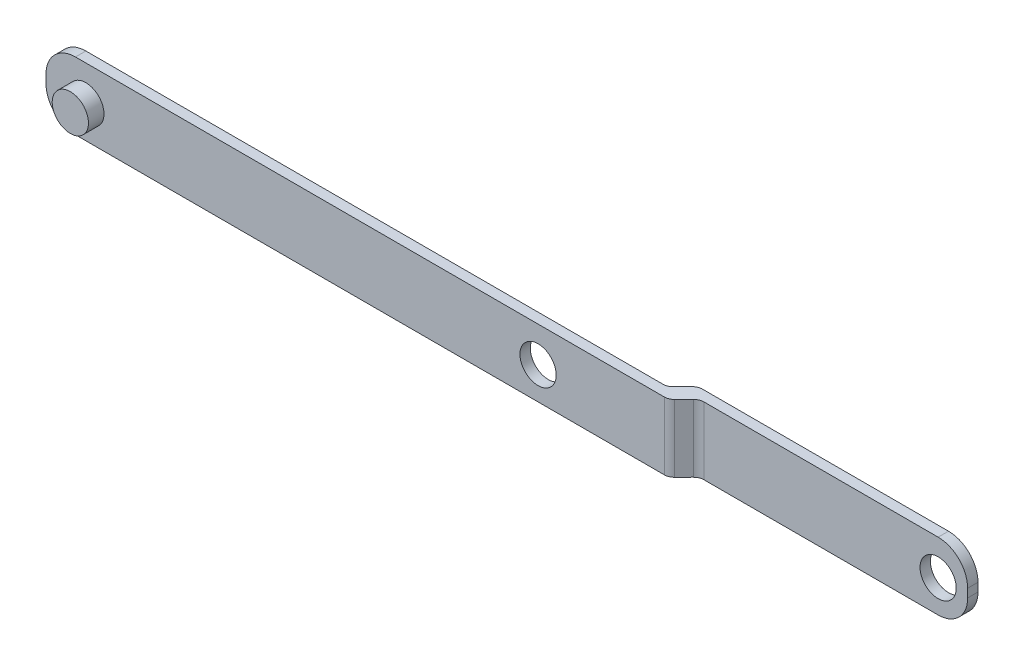
ISO-10303-21;
HEADER;
FILE_DESCRIPTION(('STEP AP214'),'2;1');
FILE_NAME('part.step','',(''),(''),'','','');
FILE_SCHEMA(('AUTOMOTIVE_DESIGN { 1 0 10303 214 1 1 1 1 }'));
ENDSEC;
DATA;
#1=APPLICATION_CONTEXT('core data for automotive mechanical design processes');
#2=APPLICATION_PROTOCOL_DEFINITION('international standard','automotive_design',2000,#1);
#3=PRODUCT_CONTEXT('',#1,'mechanical');
#4=PRODUCT('Part','Part','',(#3));
#5=PRODUCT_RELATED_PRODUCT_CATEGORY('part','',(#4));
#6=PRODUCT_DEFINITION_FORMATION('','',#4);
#7=PRODUCT_DEFINITION_CONTEXT('part definition',#1,'design');
#8=PRODUCT_DEFINITION('design','',#6,#7);
#9=PRODUCT_DEFINITION_SHAPE('','',#8);
#10=(LENGTH_UNIT() NAMED_UNIT(*) SI_UNIT(.MILLI.,.METRE.));
#11=(NAMED_UNIT(*) PLANE_ANGLE_UNIT() SI_UNIT($,.RADIAN.));
#12=(NAMED_UNIT(*) SI_UNIT($,.STERADIAN.) SOLID_ANGLE_UNIT());
#13=UNCERTAINTY_MEASURE_WITH_UNIT(LENGTH_MEASURE(1.E-05),#10,'distance_accuracy_value','');
#14=(GEOMETRIC_REPRESENTATION_CONTEXT(3) GLOBAL_UNCERTAINTY_ASSIGNED_CONTEXT((#13)) GLOBAL_UNIT_ASSIGNED_CONTEXT((#10,
#11,#12)) REPRESENTATION_CONTEXT('',''));
#15=CARTESIAN_POINT('',(0.,0.,0.));
#16=DIRECTION('',(0.,0.,1.));
#17=DIRECTION('',(1.,0.,0.));
#18=AXIS2_PLACEMENT_3D('',#15,#16,#17);
#19=CARTESIAN_POINT('',(82.1603696587962,-0.538806436098636,5.));
#20=DIRECTION('',(0.,0.,1.));
#21=DIRECTION('',(1.,0.,0.));
#22=AXIS2_PLACEMENT_3D('',#19,#20,#21);
#23=PLANE('',#22);
#24=CARTESIAN_POINT('',(-79.4418956808834,0.,5.));
#25=DIRECTION('',(0.,0.,1.));
#26=DIRECTION('',(1.,0.,0.));
#27=AXIS2_PLACEMENT_3D('',#24,#25,#26);
#28=CIRCLE('',#27,3.50000000000001);
#29=CARTESIAN_POINT('',(-75.9418956808834,0.,5.));
#30=VERTEX_POINT('',#29);
#31=EDGE_CURVE('E431',#30,#30,#28,.T.);
#32=ORIENTED_EDGE('',*,*,#31,.F.);
#33=EDGE_LOOP('',(#32));
#34=FACE_BOUND('',#33,.T.);
#35=DIRECTION('',(0.999999997302536,-7.34501783050523E-05,0.));
#36=VECTOR('',#35,1.);
#37=CARTESIAN_POINT('',(-81.4446995578788,-6.22446404853457,5.));
#38=LINE('',#37,#36);
#39=CARTESIAN_POINT('',(-81.4446995578788,-6.22446404853458,5.));
#40=VERTEX_POINT('',#39);
#41=CARTESIAN_POINT('',(32.2717692486687,-6.23281654346716,5.));
#42=VERTEX_POINT('',#41);
#43=EDGE_CURVE('E358',#40,#42,#38,.T.);
#44=ORIENTED_EDGE('',*,*,#43,.T.);
#45=DIRECTION('',(7.34501783050048E-05,0.999999997302536,0.));
#46=VECTOR('',#45,1.);
#47=CARTESIAN_POINT('',(32.2727258091304,6.79043923535657,5.));
#48=LINE('',#47,#46);
#49=CARTESIAN_POINT('',(32.2727258091304,6.79043923535656,5.));
#50=VERTEX_POINT('',#49);
#51=EDGE_CURVE('E287',#42,#50,#48,.T.);
#52=ORIENTED_EDGE('',*,*,#51,.T.);
#53=DIRECTION('',(-0.999999997302536,7.34501783049881E-05,0.));
#54=VECTOR('',#53,1.);
#55=CARTESIAN_POINT('',(82.1609077240558,6.78677493948971,5.));
#56=LINE('',#55,#54);
#57=CARTESIAN_POINT('',(-81.4437429974172,6.79879173028915,5.));
#58=VERTEX_POINT('',#57);
#59=EDGE_CURVE('E362',#50,#58,#56,.T.);
#60=ORIENTED_EDGE('',*,*,#59,.T.);
#61=CARTESIAN_POINT('',(-81.4441614926191,1.10111732705376,5.));
#62=DIRECTION('',(0.,0.,1.));
#63=DIRECTION('',(1.,0.,0.));
#64=AXIS2_PLACEMENT_3D('',#61,#62,#63);
#65=CIRCLE('',#64,5.69767441860467);
#66=CARTESIAN_POINT('',(-87.1418358958545,1.10153582225575,5.));
#67=VERTEX_POINT('',#66);
#68=EDGE_CURVE('E366',#58,#67,#65,.T.);
#69=ORIENTED_EDGE('',*,*,#68,.T.);
#70=DIRECTION('',(-7.34501783028084E-05,-0.999999997302536,0.));
#71=VECTOR('',#70,1.);
#72=CARTESIAN_POINT('',(-87.1418358958545,1.10153582225575,5.));
#73=LINE('',#72,#71);
#74=CARTESIAN_POINT('',(-87.1419554659122,-0.526371150097198,5.));
#75=VERTEX_POINT('',#74);
#76=EDGE_CURVE('E369',#67,#75,#73,.T.);
#77=ORIENTED_EDGE('',*,*,#76,.T.);
#78=CARTESIAN_POINT('',(-81.4442810626769,-0.526789645299211,5.));
#79=DIRECTION('',(0.,0.,1.));
#80=DIRECTION('',(1.,0.,0.));
#81=AXIS2_PLACEMENT_3D('',#78,#79,#80);
#82=CIRCLE('',#81,5.69767441860464);
#83=EDGE_CURVE('E372',#75,#40,#82,.T.);
#84=ORIENTED_EDGE('',*,*,#83,.T.);
#85=EDGE_LOOP('',(#44,#52,#60,#69,#77,#84));
#86=FACE_BOUND('',#85,.T.);
#87=CARTESIAN_POINT('',(7.89311265879616,0.,5.));
#88=DIRECTION('',(0.,0.,1.));
#89=DIRECTION('',(1.,0.,0.));
#90=AXIS2_PLACEMENT_3D('',#87,#88,#89);
#91=CIRCLE('',#90,3.5);
#92=CARTESIAN_POINT('',(11.3931126587962,0.,5.));
#93=VERTEX_POINT('',#92);
#94=EDGE_CURVE('E349',#93,#93,#91,.T.);
#95=ORIENTED_EDGE('',*,*,#94,.F.);
#96=EDGE_LOOP('',(#95));
#97=FACE_BOUND('',#96,.T.);
#98=ADVANCED_FACE('F105',(#34,#86,#97),#23,.T.);
#99=CARTESIAN_POINT('',(82.1603696587962,-0.538806436098636,0.));
#100=DIRECTION('',(0.,0.,1.));
#101=DIRECTION('',(1.,0.,0.));
#102=AXIS2_PLACEMENT_3D('',#99,#100,#101);
#103=PLANE('',#102);
#104=DIRECTION('',(0.999999997302536,-7.34501783051125E-05,0.));
#105=VECTOR('',#104,1.);
#106=CARTESIAN_POINT('',(1.13848456822041,-6.23052979814999,0.));
#107=LINE('',#106,#105);
#108=CARTESIAN_POINT('',(34.6435184012548,-6.23299074886579,0.));
#109=VERTEX_POINT('',#108);
#110=CARTESIAN_POINT('',(82.1599511635942,-6.23648083933402,0.));
#111=VERTEX_POINT('',#110);
#112=EDGE_CURVE('E357',#109,#111,#107,.T.);
#113=ORIENTED_EDGE('',*,*,#112,.F.);
#114=DIRECTION('',(7.34501783050048E-05,0.999999997302536,0.));
#115=VECTOR('',#114,1.);
#116=CARTESIAN_POINT('',(34.6439368964568,-0.53531634563041,0.));
#117=LINE('',#116,#115);
#118=CARTESIAN_POINT('',(34.6444749617165,6.79026502995794,0.));
#119=VERTEX_POINT('',#118);
#120=EDGE_CURVE('E302',#109,#119,#117,.T.);
#121=ORIENTED_EDGE('',*,*,#120,.T.);
#122=DIRECTION('',(-0.999999997302536,7.34501783050048E-05,0.));
#123=VECTOR('',#122,1.);
#124=CARTESIAN_POINT('',(8.34427093476067,6.79219678463839,0.));
#125=LINE('',#124,#123);
#126=CARTESIAN_POINT('',(82.1609077240558,6.7867749394897,0.));
#127=VERTEX_POINT('',#126);
#128=EDGE_CURVE('E363',#127,#119,#125,.T.);
#129=ORIENTED_EDGE('',*,*,#128,.F.);
#130=CARTESIAN_POINT('',(82.1604892288539,1.08910053625432,0.));
#131=DIRECTION('',(0.,0.,1.));
#132=DIRECTION('',(1.,0.,0.));
#133=AXIS2_PLACEMENT_3D('',#130,#131,#132);
#134=CIRCLE('',#133,5.69767441860466);
#135=CARTESIAN_POINT('',(87.8581636320893,1.08868204105236,0.));
#136=VERTEX_POINT('',#135);
#137=EDGE_CURVE('E248',#136,#127,#134,.T.);
#138=ORIENTED_EDGE('',*,*,#137,.F.);
#139=DIRECTION('',(7.34501783028071E-05,0.999999997302536,0.));
#140=VECTOR('',#139,1.);
#141=CARTESIAN_POINT('',(87.8580440620316,-0.539224931300621,0.));
#142=LINE('',#141,#140);
#143=CARTESIAN_POINT('',(87.8580440620316,-0.53922493130062,0.));
#144=VERTEX_POINT('',#143);
#145=EDGE_CURVE('E382',#144,#136,#142,.T.);
#146=ORIENTED_EDGE('',*,*,#145,.F.);
#147=CARTESIAN_POINT('',(82.1603696587962,-0.538806436098636,0.));
#148=DIRECTION('',(0.,0.,1.));
#149=DIRECTION('',(1.,0.,0.));
#150=AXIS2_PLACEMENT_3D('',#147,#148,#149);
#151=CIRCLE('',#150,5.69767441860465);
#152=EDGE_CURVE('E378',#111,#144,#151,.T.);
#153=ORIENTED_EDGE('',*,*,#152,.F.);
#154=EDGE_LOOP('',(#113,#121,#129,#138,#146,#153));
#155=FACE_BOUND('',#154,.T.);
#156=CARTESIAN_POINT('',(82.1603696587962,0.,0.));
#157=DIRECTION('',(0.,0.,1.));
#158=DIRECTION('',(1.,0.,0.));
#159=AXIS2_PLACEMENT_3D('',#156,#157,#158);
#160=CIRCLE('',#159,3.50000000000001);
#161=CARTESIAN_POINT('',(85.6603696587962,0.,0.));
#162=VERTEX_POINT('',#161);
#163=EDGE_CURVE('E343',#162,#162,#160,.T.);
#164=ORIENTED_EDGE('',*,*,#163,.T.);
#165=EDGE_LOOP('',(#164));
#166=FACE_BOUND('',#165,.T.);
#167=ADVANCED_FACE('F449',(#155,#166),#103,.F.);
#168=CARTESIAN_POINT('',(1.13848456822041,-6.23052979814999,5.));
#169=DIRECTION('',(7.34501783051125E-05,0.999999997302536,0.));
#170=DIRECTION('',(-0.999999997302536,7.34501783051125E-05,0.));
#171=AXIS2_PLACEMENT_3D('',#168,#169,#170);
#172=PLANE('',#171);
#173=DIRECTION('',(-0.703409872444509,5.16655806919916E-05,0.710784460070891));
#174=VECTOR('',#173,1.);
#175=CARTESIAN_POINT('',(17.2890962404443,-6.23171606346026,20.983044643964));
#176=LINE('',#175,#174);
#177=CARTESIAN_POINT('',(35.4881606451642,-6.23305278798937,2.59318025131616));
#178=VERTEX_POINT('',#177);
#179=CARTESIAN_POINT('',(33.6933381649759,-6.23292095795782,4.40681974868386));
#180=VERTEX_POINT('',#179);
#181=EDGE_CURVE('E344',#178,#180,#176,.T.);
#182=ORIENTED_EDGE('',*,*,#181,.T.);
#183=CARTESIAN_POINT('',(32.2717692486687,-6.23281654346717,3.));
#184=DIRECTION('',(7.34501783051125E-05,0.999999997302536,0.));
#185=DIRECTION('',(-0.999999997302536,7.34501783051125E-05,0.));
#186=AXIS2_PLACEMENT_3D('',#183,#184,#185);
#187=CIRCLE('',#186,2.);
#188=EDGE_CURVE('E299',#180,#42,#187,.F.);
#189=ORIENTED_EDGE('',*,*,#188,.T.);
#190=ORIENTED_EDGE('',*,*,#43,.F.);
#191=DIRECTION('',(0.,0.,-1.));
#192=VECTOR('',#191,1.);
#193=CARTESIAN_POINT('',(-81.4446995578788,-6.22446404853458,5.));
#194=LINE('',#193,#192);
#195=CARTESIAN_POINT('',(-81.4446995578788,-6.22446404853458,3.));
#196=VERTEX_POINT('',#195);
#197=EDGE_CURVE('E375',#40,#196,#194,.T.);
#198=ORIENTED_EDGE('',*,*,#197,.T.);
#199=DIRECTION('',(0.999999997302536,-7.34501783051125E-05,0.));
#200=VECTOR('',#199,1.);
#201=CARTESIAN_POINT('',(1.13848456822041,-6.23052979814999,3.));
#202=LINE('',#201,#200);
#203=CARTESIAN_POINT('',(30.0055580884522,-6.23265008985292,3.));
#204=VERTEX_POINT('',#203);
#205=EDGE_CURVE('E340',#196,#204,#202,.T.);
#206=ORIENTED_EDGE('',*,*,#205,.T.);
#207=CARTESIAN_POINT('',(30.0055580884522,-6.23265008985292,1.));
#208=DIRECTION('',(7.34501783051125E-05,0.999999997302536,0.));
#209=DIRECTION('',(-0.999999997302536,7.34501783051125E-05,0.));
#210=AXIS2_PLACEMENT_3D('',#207,#208,#209);
#211=CIRCLE('',#210,2.);
#212=CARTESIAN_POINT('',(31.4271270047593,-6.23275450434358,2.40681974868386));
#213=VERTEX_POINT('',#212);
#214=EDGE_CURVE('E12',#204,#213,#211,.T.);
#215=ORIENTED_EDGE('',*,*,#214,.T.);
#216=DIRECTION('',(0.703409872444509,-5.16655806919917E-05,-0.710784460070891));
#217=VECTOR('',#216,1.);
#218=CARTESIAN_POINT('',(15.1442277791378,-6.23155852248891,18.8604297815529));
#219=LINE('',#218,#217);
#220=CARTESIAN_POINT('',(33.2219494849477,-6.23288633437513,0.593180251316133));
#221=VERTEX_POINT('',#220);
#222=EDGE_CURVE('E338',#213,#221,#219,.T.);
#223=ORIENTED_EDGE('',*,*,#222,.T.);
#224=CARTESIAN_POINT('',(34.6435184012548,-6.23299074886579,2.));
#225=DIRECTION('',(7.34501783051125E-05,0.999999997302536,0.));
#226=DIRECTION('',(-0.999999997302536,7.34501783051125E-05,0.));
#227=AXIS2_PLACEMENT_3D('',#224,#225,#226);
#228=CIRCLE('',#227,2.);
#229=EDGE_CURVE('E121',#221,#109,#228,.F.);
#230=ORIENTED_EDGE('',*,*,#229,.T.);
#231=ORIENTED_EDGE('',*,*,#112,.T.);
#232=DIRECTION('',(0.,0.,-1.));
#233=VECTOR('',#232,1.);
#234=CARTESIAN_POINT('',(82.1599511635942,-6.23648083933402,5.));
#235=LINE('',#234,#233);
#236=CARTESIAN_POINT('',(82.1599511635942,-6.23648083933402,2.00000000000001));
#237=VERTEX_POINT('',#236);
#238=EDGE_CURVE('E264',#237,#111,#235,.T.);
#239=ORIENTED_EDGE('',*,*,#238,.F.);
#240=DIRECTION('',(-0.999999997302536,7.34501783051125E-05,0.));
#241=VECTOR('',#240,1.);
#242=CARTESIAN_POINT('',(1.13848456822041,-6.23052979814999,2.00000000000005));
#243=LINE('',#242,#241);
#244=CARTESIAN_POINT('',(36.9097295614713,-6.23315720248003,2.00000000000003));
#245=VERTEX_POINT('',#244);
#246=EDGE_CURVE('E277',#237,#245,#243,.T.);
#247=ORIENTED_EDGE('',*,*,#246,.T.);
#248=CARTESIAN_POINT('',(36.9097295614713,-6.23315720248003,4.00000000000003));
#249=DIRECTION('',(7.34501783051125E-05,0.999999997302536,0.));
#250=DIRECTION('',(-0.999999997302536,7.34501783051125E-05,0.));
#251=AXIS2_PLACEMENT_3D('',#248,#249,#250);
#252=CIRCLE('',#251,2.);
#253=EDGE_CURVE('E317',#245,#178,#252,.T.);
#254=ORIENTED_EDGE('',*,*,#253,.T.);
#255=EDGE_LOOP('',(#182,#189,#190,#198,#206,#215,#223,#230,#231,#239,#247,#254));
#256=FACE_BOUND('',#255,.T.);
#257=ADVANCED_FACE('F337',(#256),#172,.F.);
#258=CARTESIAN_POINT('',(82.1603696587962,-0.538806436098636,5.));
#259=DIRECTION('',(0.,0.,-1.));
#260=DIRECTION('',(-1.,0.,0.));
#261=AXIS2_PLACEMENT_3D('',#258,#259,#260);
#262=CYLINDRICAL_SURFACE('',#261,5.69767441860465);
#263=DIRECTION('',(0.,0.,-1.));
#264=VECTOR('',#263,1.);
#265=CARTESIAN_POINT('',(87.8580440620316,-0.53922493130062,5.));
#266=LINE('',#265,#264);
#267=CARTESIAN_POINT('',(87.8580440620316,-0.53922493130062,2.00000000000001));
#268=VERTEX_POINT('',#267);
#269=EDGE_CURVE('E255',#268,#144,#266,.T.);
#270=ORIENTED_EDGE('',*,*,#269,.F.);
#271=CARTESIAN_POINT('',(82.1603696587962,-0.538806436098636,2.00000000000001));
#272=DIRECTION('',(0.,0.,-1.));
#273=DIRECTION('',(-1.,0.,0.));
#274=AXIS2_PLACEMENT_3D('',#271,#272,#273);
#275=CIRCLE('',#274,5.69767441860465);
#276=EDGE_CURVE('E419',#268,#237,#275,.T.);
#277=ORIENTED_EDGE('',*,*,#276,.T.);
#278=ORIENTED_EDGE('',*,*,#238,.T.);
#279=ORIENTED_EDGE('',*,*,#152,.T.);
#280=EDGE_LOOP('',(#270,#277,#278,#279));
#281=FACE_BOUND('',#280,.T.);
#282=ADVANCED_FACE('F488',(#281),#262,.T.);
#283=CARTESIAN_POINT('',(87.8580440620316,-0.539224931300621,5.));
#284=DIRECTION('',(-0.999999997302536,7.34501783028071E-05,0.));
#285=DIRECTION('',(-7.34501783028071E-05,-0.999999997302536,0.));
#286=AXIS2_PLACEMENT_3D('',#283,#284,#285);
#287=PLANE('',#286);
#288=DIRECTION('',(0.,0.,-1.));
#289=VECTOR('',#288,1.);
#290=CARTESIAN_POINT('',(87.8581636320893,1.08868204105236,5.));
#291=LINE('',#290,#289);
#292=CARTESIAN_POINT('',(87.8581636320893,1.08868204105236,2.00000000000001));
#293=VERTEX_POINT('',#292);
#294=EDGE_CURVE('E250',#293,#136,#291,.T.);
#295=ORIENTED_EDGE('',*,*,#294,.F.);
#296=DIRECTION('',(-7.34501783028071E-05,-0.999999997302536,0.));
#297=VECTOR('',#296,1.);
#298=CARTESIAN_POINT('',(87.8580440620316,-0.539224931300621,2.00000000000001));
#299=LINE('',#298,#297);
#300=EDGE_CURVE('E226',#293,#268,#299,.T.);
#301=ORIENTED_EDGE('',*,*,#300,.T.);
#302=ORIENTED_EDGE('',*,*,#269,.T.);
#303=ORIENTED_EDGE('',*,*,#145,.T.);
#304=EDGE_LOOP('',(#295,#301,#302,#303));
#305=FACE_BOUND('',#304,.T.);
#306=ADVANCED_FACE('F485',(#305),#287,.F.);
#307=CARTESIAN_POINT('',(82.1604892288539,1.08910053625432,5.));
#308=DIRECTION('',(0.,0.,-1.));
#309=DIRECTION('',(-1.,0.,0.));
#310=AXIS2_PLACEMENT_3D('',#307,#308,#309);
#311=CYLINDRICAL_SURFACE('',#310,5.69767441860466);
#312=DIRECTION('',(0.,0.,-1.));
#313=VECTOR('',#312,1.);
#314=CARTESIAN_POINT('',(82.1609077240558,6.7867749394897,5.));
#315=LINE('',#314,#313);
#316=CARTESIAN_POINT('',(82.1609077240558,6.78677493948971,2.00000000000001));
#317=VERTEX_POINT('',#316);
#318=EDGE_CURVE('E237',#317,#127,#315,.T.);
#319=ORIENTED_EDGE('',*,*,#318,.F.);
#320=CARTESIAN_POINT('',(82.1604892288539,1.08910053625432,2.00000000000001));
#321=DIRECTION('',(0.,0.,-1.));
#322=DIRECTION('',(-1.,0.,0.));
#323=AXIS2_PLACEMENT_3D('',#320,#321,#322);
#324=CIRCLE('',#323,5.69767441860466);
#325=EDGE_CURVE('E220',#317,#293,#324,.T.);
#326=ORIENTED_EDGE('',*,*,#325,.T.);
#327=ORIENTED_EDGE('',*,*,#294,.T.);
#328=ORIENTED_EDGE('',*,*,#137,.T.);
#329=EDGE_LOOP('',(#319,#326,#327,#328));
#330=FACE_BOUND('',#329,.T.);
#331=ADVANCED_FACE('F246',(#330),#311,.T.);
#332=CARTESIAN_POINT('',(8.34427093476067,6.79219678463839,5.));
#333=DIRECTION('',(-7.34501783050048E-05,-0.999999997302536,0.));
#334=DIRECTION('',(0.999999997302536,-7.34501783050048E-05,0.));
#335=AXIS2_PLACEMENT_3D('',#332,#333,#334);
#336=PLANE('',#335);
#337=ORIENTED_EDGE('',*,*,#59,.F.);
#338=CARTESIAN_POINT('',(32.2727258091304,6.79043923535656,3.));
#339=DIRECTION('',(-7.34501783050048E-05,-0.999999997302536,0.));
#340=DIRECTION('',(0.999999997302536,-7.34501783050048E-05,0.));
#341=AXIS2_PLACEMENT_3D('',#338,#339,#340);
#342=CIRCLE('',#341,2.);
#343=CARTESIAN_POINT('',(33.6942947254375,6.79033482086591,4.40681974868387));
#344=VERTEX_POINT('',#343);
#345=EDGE_CURVE('E294',#50,#344,#342,.F.);
#346=ORIENTED_EDGE('',*,*,#345,.T.);
#347=DIRECTION('',(-0.703409872444509,5.16655806919567E-05,0.710784460070891));
#348=VECTOR('',#347,1.);
#349=CARTESIAN_POINT('',(36.076143045883,6.7901598736816,2.00000000000004));
#350=LINE('',#349,#348);
#351=CARTESIAN_POINT('',(35.4891172056258,6.79020299083435,2.59318025131617));
#352=VERTEX_POINT('',#351);
#353=EDGE_CURVE('E242',#352,#344,#350,.T.);
#354=ORIENTED_EDGE('',*,*,#353,.F.);
#355=CARTESIAN_POINT('',(36.910686121933,6.79009857634369,4.00000000000003));
#356=DIRECTION('',(-7.34501783050048E-05,-0.999999997302536,0.));
#357=DIRECTION('',(0.999999997302536,-7.34501783050048E-05,0.));
#358=AXIS2_PLACEMENT_3D('',#355,#356,#357);
#359=CIRCLE('',#358,2.);
#360=CARTESIAN_POINT('',(36.910686121933,6.7900985763437,2.00000000000003));
#361=VERTEX_POINT('',#360);
#362=EDGE_CURVE('E240',#352,#361,#359,.T.);
#363=ORIENTED_EDGE('',*,*,#362,.T.);
#364=DIRECTION('',(-0.999999997302536,7.34501783050071E-05,0.));
#365=VECTOR('',#364,1.);
#366=CARTESIAN_POINT('',(36.076143045883,6.7901598736816,2.00000000000004));
#367=LINE('',#366,#365);
#368=EDGE_CURVE('E223',#317,#361,#367,.T.);
#369=ORIENTED_EDGE('',*,*,#368,.F.);
#370=ORIENTED_EDGE('',*,*,#318,.T.);
#371=ORIENTED_EDGE('',*,*,#128,.T.);
#372=CARTESIAN_POINT('',(34.6444749617165,6.79026502995794,2.));
#373=DIRECTION('',(-7.34501783050048E-05,-0.999999997302536,0.));
#374=DIRECTION('',(0.999999997302536,-7.34501783050048E-05,0.));
#375=AXIS2_PLACEMENT_3D('',#372,#373,#374);
#376=CIRCLE('',#375,2.);
#377=CARTESIAN_POINT('',(33.2229060454093,6.7903694444486,0.593180251316138));
#378=VERTEX_POINT('',#377);
#379=EDGE_CURVE('E291',#119,#378,#376,.F.);
#380=ORIENTED_EDGE('',*,*,#379,.T.);
#381=DIRECTION('',(0.703409872444509,-5.16655806919561E-05,-0.71078446007089));
#382=VECTOR('',#381,1.);
#383=CARTESIAN_POINT('',(30.8410577249638,6.7905443916329,3.));
#384=LINE('',#383,#382);
#385=CARTESIAN_POINT('',(31.428083565221,6.79050127448015,2.40681974868387));
#386=VERTEX_POINT('',#385);
#387=EDGE_CURVE('E324',#386,#378,#384,.T.);
#388=ORIENTED_EDGE('',*,*,#387,.F.);
#389=CARTESIAN_POINT('',(30.0065146489138,6.7906056889708,1.));
#390=DIRECTION('',(-7.34501783050048E-05,-0.999999997302536,0.));
#391=DIRECTION('',(0.999999997302536,-7.34501783050048E-05,0.));
#392=AXIS2_PLACEMENT_3D('',#389,#390,#391);
#393=CIRCLE('',#392,2.);
#394=CARTESIAN_POINT('',(30.0065146489138,6.79060568897081,3.));
#395=VERTEX_POINT('',#394);
#396=EDGE_CURVE('E114',#386,#395,#393,.T.);
#397=ORIENTED_EDGE('',*,*,#396,.T.);
#398=DIRECTION('',(0.999999997302536,-7.34501783050038E-05,0.));
#399=VECTOR('',#398,1.);
#400=CARTESIAN_POINT('',(-97.1877129219609,6.79994812769046,3.));
#401=LINE('',#400,#399);
#402=CARTESIAN_POINT('',(-81.4437429974172,6.79879173028915,3.));
#403=VERTEX_POINT('',#402);
#404=EDGE_CURVE('E243',#403,#395,#401,.T.);
#405=ORIENTED_EDGE('',*,*,#404,.F.);
#406=DIRECTION('',(0.,0.,-1.));
#407=VECTOR('',#406,1.);
#408=CARTESIAN_POINT('',(-81.4437429974172,6.79879173028915,5.));
#409=LINE('',#408,#407);
#410=EDGE_CURVE('E251',#58,#403,#409,.T.);
#411=ORIENTED_EDGE('',*,*,#410,.F.);
#412=EDGE_LOOP('',(#337,#346,#354,#363,#369,#370,#371,#380,#388,#397,#405,#411));
#413=FACE_BOUND('',#412,.T.);
#414=ADVANCED_FACE('F235',(#413),#336,.F.);
#415=CARTESIAN_POINT('',(-81.4441614926191,1.10111732705376,5.));
#416=DIRECTION('',(0.,0.,-1.));
#417=DIRECTION('',(-1.,0.,0.));
#418=AXIS2_PLACEMENT_3D('',#415,#416,#417);
#419=CYLINDRICAL_SURFACE('',#418,5.69767441860467);
#420=ORIENTED_EDGE('',*,*,#410,.T.);
#421=CARTESIAN_POINT('',(-81.4441614926191,1.10111732705376,3.));
#422=DIRECTION('',(0.,0.,1.));
#423=DIRECTION('',(1.,0.,0.));
#424=AXIS2_PLACEMENT_3D('',#421,#422,#423);
#425=CIRCLE('',#424,5.69767441860467);
#426=CARTESIAN_POINT('',(-87.1418358958545,1.10153582225575,3.));
#427=VERTEX_POINT('',#426);
#428=EDGE_CURVE('E332',#403,#427,#425,.T.);
#429=ORIENTED_EDGE('',*,*,#428,.T.);
#430=DIRECTION('',(0.,0.,-1.));
#431=VECTOR('',#430,1.);
#432=CARTESIAN_POINT('',(-87.1418358958545,1.10153582225575,5.));
#433=LINE('',#432,#431);
#434=EDGE_CURVE('E258',#67,#427,#433,.T.);
#435=ORIENTED_EDGE('',*,*,#434,.F.);
#436=ORIENTED_EDGE('',*,*,#68,.F.);
#437=EDGE_LOOP('',(#420,#429,#435,#436));
#438=FACE_BOUND('',#437,.T.);
#439=ADVANCED_FACE('F406',(#438),#419,.T.);
#440=CARTESIAN_POINT('',(-87.1418358958545,1.10153582225575,5.));
#441=DIRECTION('',(0.999999997302536,-7.34501783028084E-05,0.));
#442=DIRECTION('',(7.34501783028084E-05,0.999999997302536,0.));
#443=AXIS2_PLACEMENT_3D('',#440,#441,#442);
#444=PLANE('',#443);
#445=ORIENTED_EDGE('',*,*,#434,.T.);
#446=DIRECTION('',(-7.34501783028084E-05,-0.999999997302536,0.));
#447=VECTOR('',#446,1.);
#448=CARTESIAN_POINT('',(-87.1418358958545,1.10153582225575,3.));
#449=LINE('',#448,#447);
#450=CARTESIAN_POINT('',(-87.1419554659122,-0.526371150097198,3.));
#451=VERTEX_POINT('',#450);
#452=EDGE_CURVE('E403',#427,#451,#449,.T.);
#453=ORIENTED_EDGE('',*,*,#452,.T.);
#454=DIRECTION('',(0.,0.,-1.));
#455=VECTOR('',#454,1.);
#456=CARTESIAN_POINT('',(-87.1419554659122,-0.526371150097198,5.));
#457=LINE('',#456,#455);
#458=EDGE_CURVE('E392',#75,#451,#457,.T.);
#459=ORIENTED_EDGE('',*,*,#458,.F.);
#460=ORIENTED_EDGE('',*,*,#76,.F.);
#461=EDGE_LOOP('',(#445,#453,#459,#460));
#462=FACE_BOUND('',#461,.T.);
#463=ADVANCED_FACE('F401',(#462),#444,.F.);
#464=CARTESIAN_POINT('',(-81.4442810626769,-0.526789645299211,5.));
#465=DIRECTION('',(0.,0.,-1.));
#466=DIRECTION('',(-1.,0.,0.));
#467=AXIS2_PLACEMENT_3D('',#464,#465,#466);
#468=CYLINDRICAL_SURFACE('',#467,5.69767441860464);
#469=ORIENTED_EDGE('',*,*,#458,.T.);
#470=CARTESIAN_POINT('',(-81.4442810626769,-0.526789645299211,3.));
#471=DIRECTION('',(0.,0.,1.));
#472=DIRECTION('',(1.,0.,0.));
#473=AXIS2_PLACEMENT_3D('',#470,#471,#472);
#474=CIRCLE('',#473,5.69767441860464);
#475=EDGE_CURVE('E276',#451,#196,#474,.T.);
#476=ORIENTED_EDGE('',*,*,#475,.T.);
#477=ORIENTED_EDGE('',*,*,#197,.F.);
#478=ORIENTED_EDGE('',*,*,#83,.F.);
#479=EDGE_LOOP('',(#469,#476,#477,#478));
#480=FACE_BOUND('',#479,.T.);
#481=ADVANCED_FACE('F459',(#480),#468,.T.);
#482=CARTESIAN_POINT('',(7.89311265879616,0.,5.));
#483=DIRECTION('',(0.,0.,-1.));
#484=DIRECTION('',(-1.,0.,0.));
#485=AXIS2_PLACEMENT_3D('',#482,#483,#484);
#486=CYLINDRICAL_SURFACE('',#485,3.5);
#487=CARTESIAN_POINT('',(7.89311265879616,0.,3.));
#488=DIRECTION('',(0.,0.,1.));
#489=DIRECTION('',(1.,0.,0.));
#490=AXIS2_PLACEMENT_3D('',#487,#488,#489);
#491=CIRCLE('',#490,3.5);
#492=CARTESIAN_POINT('',(11.3931126587962,0.,3.));
#493=VERTEX_POINT('',#492);
#494=EDGE_CURVE('E272',#493,#493,#491,.T.);
#495=ORIENTED_EDGE('',*,*,#494,.F.);
#496=EDGE_LOOP('',(#495));
#497=FACE_BOUND('',#496,.T.);
#498=ORIENTED_EDGE('',*,*,#94,.T.);
#499=EDGE_LOOP('',(#498));
#500=FACE_BOUND('',#499,.T.);
#501=ADVANCED_FACE('F456',(#497,#500),#486,.F.);
#502=CARTESIAN_POINT('',(82.1603696587962,0.,5.));
#503=DIRECTION('',(0.,0.,-1.));
#504=DIRECTION('',(-1.,0.,0.));
#505=AXIS2_PLACEMENT_3D('',#502,#503,#504);
#506=CYLINDRICAL_SURFACE('',#505,3.50000000000001);
#507=CARTESIAN_POINT('',(82.1603696587962,0.,2.00000000000001));
#508=DIRECTION('',(0.,0.,-1.));
#509=DIRECTION('',(-1.,0.,0.));
#510=AXIS2_PLACEMENT_3D('',#507,#508,#509);
#511=CIRCLE('',#510,3.50000000000001);
#512=CARTESIAN_POINT('',(78.6603696587962,0.,2.00000000000001));
#513=VERTEX_POINT('',#512);
#514=EDGE_CURVE('E231',#513,#513,#511,.T.);
#515=ORIENTED_EDGE('',*,*,#514,.F.);
#516=EDGE_LOOP('',(#515));
#517=FACE_BOUND('',#516,.T.);
#518=ORIENTED_EDGE('',*,*,#163,.F.);
#519=EDGE_LOOP('',(#518));
#520=FACE_BOUND('',#519,.T.);
#521=ADVANCED_FACE('F458',(#517,#520),#506,.F.);
#522=CARTESIAN_POINT('',(36.0751855720485,-6.2455311757083,2.00000000000004));
#523=DIRECTION('',(-0.710784458153575,5.22072453286335E-05,-0.703409874341932));
#524=DIRECTION('',(-0.703409875300537,0.,0.710784459122231));
#525=AXIS2_PLACEMENT_3D('',#522,#523,#524);
#526=PLANE('',#525);
#527=ORIENTED_EDGE('',*,*,#181,.F.);
#528=DIRECTION('',(7.34501783050048E-05,0.999999997302536,0.));
#529=VECTOR('',#528,1.);
#530=CARTESIAN_POINT('',(35.4891172056258,6.79020299083435,2.59318025131617));
#531=LINE('',#530,#529);
#532=EDGE_CURVE('E280',#178,#352,#531,.T.);
#533=ORIENTED_EDGE('',*,*,#532,.T.);
#534=ORIENTED_EDGE('',*,*,#353,.T.);
#535=DIRECTION('',(7.34501783050048E-05,0.999999997302536,0.));
#536=VECTOR('',#535,1.);
#537=CARTESIAN_POINT('',(33.6933381649759,-6.23292095795783,4.40681974868387));
#538=LINE('',#537,#536);
#539=EDGE_CURVE('E268',#344,#180,#538,.F.);
#540=ORIENTED_EDGE('',*,*,#539,.T.);
#541=EDGE_LOOP('',(#527,#533,#534,#540));
#542=FACE_BOUND('',#541,.T.);
#543=ADVANCED_FACE('F466',(#542),#526,.F.);
#544=CARTESIAN_POINT('',(36.0751855720485,-6.2455311757083,2.00000000000004));
#545=DIRECTION('',(0.,0.,-1.));
#546=DIRECTION('',(-1.,0.,0.));
#547=AXIS2_PLACEMENT_3D('',#544,#545,#546);
#548=PLANE('',#547);
#549=ORIENTED_EDGE('',*,*,#514,.T.);
#550=EDGE_LOOP('',(#549));
#551=FACE_BOUND('',#550,.T.);
#552=ORIENTED_EDGE('',*,*,#368,.T.);
#553=DIRECTION('',(7.34501783050048E-05,0.999999997302536,0.));
#554=VECTOR('',#553,1.);
#555=CARTESIAN_POINT('',(36.9097295614713,-6.23315720248003,2.00000000000003));
#556=LINE('',#555,#554);
#557=EDGE_CURVE('E284',#361,#245,#556,.F.);
#558=ORIENTED_EDGE('',*,*,#557,.T.);
#559=ORIENTED_EDGE('',*,*,#246,.F.);
#560=ORIENTED_EDGE('',*,*,#276,.F.);
#561=ORIENTED_EDGE('',*,*,#300,.F.);
#562=ORIENTED_EDGE('',*,*,#325,.F.);
#563=EDGE_LOOP('',(#552,#558,#559,#560,#561,#562));
#564=FACE_BOUND('',#563,.T.);
#565=ADVANCED_FACE('F222',(#551,#564),#548,.F.);
#566=CARTESIAN_POINT('',(30.8401002511293,-6.245146657757,3.));
#567=DIRECTION('',(0.710784458153575,-5.22072453286335E-05,0.703409874341932));
#568=DIRECTION('',(0.703409875300538,0.,-0.710784459122231));
#569=AXIS2_PLACEMENT_3D('',#566,#567,#568);
#570=PLANE('',#569);
#571=ORIENTED_EDGE('',*,*,#387,.T.);
#572=DIRECTION('',(7.34501783050048E-05,0.999999997302536,0.));
#573=VECTOR('',#572,1.);
#574=CARTESIAN_POINT('',(33.2219485715748,-6.24532160494131,0.593180251316136));
#575=LINE('',#574,#573);
#576=EDGE_CURVE('E129',#378,#221,#575,.F.);
#577=ORIENTED_EDGE('',*,*,#576,.T.);
#578=ORIENTED_EDGE('',*,*,#222,.F.);
#579=DIRECTION('',(7.34501783050048E-05,0.999999997302536,0.));
#580=VECTOR('',#579,1.);
#581=CARTESIAN_POINT('',(31.428083565221,6.79050127448015,2.40681974868387));
#582=LINE('',#581,#580);
#583=EDGE_CURVE('E306',#213,#386,#582,.T.);
#584=ORIENTED_EDGE('',*,*,#583,.T.);
#585=EDGE_LOOP('',(#571,#577,#578,#584));
#586=FACE_BOUND('',#585,.T.);
#587=ADVANCED_FACE('F341',(#586),#570,.F.);
#588=CARTESIAN_POINT('',(-97.1886703957954,-6.23574292169945,3.));
#589=DIRECTION('',(0.,0.,1.));
#590=DIRECTION('',(1.,0.,0.));
#591=AXIS2_PLACEMENT_3D('',#588,#589,#590);
#592=PLANE('',#591);
#593=ORIENTED_EDGE('',*,*,#494,.T.);
#594=EDGE_LOOP('',(#593));
#595=FACE_BOUND('',#594,.T.);
#596=ORIENTED_EDGE('',*,*,#404,.T.);
#597=DIRECTION('',(7.34501783050048E-05,0.999999997302536,0.));
#598=VECTOR('',#597,1.);
#599=CARTESIAN_POINT('',(30.0055580884522,-6.23265008985292,3.));
#600=LINE('',#599,#598);
#601=EDGE_CURVE('E312',#395,#204,#600,.F.);
#602=ORIENTED_EDGE('',*,*,#601,.T.);
#603=ORIENTED_EDGE('',*,*,#205,.F.);
#604=ORIENTED_EDGE('',*,*,#475,.F.);
#605=ORIENTED_EDGE('',*,*,#452,.F.);
#606=ORIENTED_EDGE('',*,*,#428,.F.);
#607=EDGE_LOOP('',(#596,#602,#603,#604,#605,#606));
#608=FACE_BOUND('',#607,.T.);
#609=ADVANCED_FACE('F329',(#595,#608),#592,.F.);
#610=CARTESIAN_POINT('',(36.9097286480985,-6.24559247304621,4.00000000000003));
#611=DIRECTION('',(-7.34501783050048E-05,-0.999999997302536,0.));
#612=DIRECTION('',(0.999999997302536,-7.34501783050048E-05,0.));
#613=AXIS2_PLACEMENT_3D('',#610,#611,#612);
#614=CYLINDRICAL_SURFACE('',#613,2.);
#615=ORIENTED_EDGE('',*,*,#253,.F.);
#616=ORIENTED_EDGE('',*,*,#557,.F.);
#617=ORIENTED_EDGE('',*,*,#362,.F.);
#618=ORIENTED_EDGE('',*,*,#532,.F.);
#619=EDGE_LOOP('',(#615,#616,#617,#618));
#620=FACE_BOUND('',#619,.T.);
#621=ADVANCED_FACE('F495',(#620),#614,.F.);
#622=CARTESIAN_POINT('',(32.2721877438707,-0.535142140231788,3.));
#623=DIRECTION('',(-7.34501783050048E-05,-0.999999997302536,0.));
#624=DIRECTION('',(0.999999997302536,-7.34501783050048E-05,0.));
#625=AXIS2_PLACEMENT_3D('',#622,#623,#624);
#626=CYLINDRICAL_SURFACE('',#625,2.);
#627=ORIENTED_EDGE('',*,*,#188,.F.);
#628=ORIENTED_EDGE('',*,*,#539,.F.);
#629=ORIENTED_EDGE('',*,*,#345,.F.);
#630=ORIENTED_EDGE('',*,*,#51,.F.);
#631=EDGE_LOOP('',(#627,#628,#629,#630));
#632=FACE_BOUND('',#631,.T.);
#633=ADVANCED_FACE('F498',(#632),#626,.T.);
#634=CARTESIAN_POINT('',(34.6439368964568,-0.53531634563041,2.));
#635=DIRECTION('',(7.34501783050048E-05,0.999999997302536,0.));
#636=DIRECTION('',(-0.999999997302536,7.34501783050048E-05,0.));
#637=AXIS2_PLACEMENT_3D('',#634,#635,#636);
#638=CYLINDRICAL_SURFACE('',#637,2.);
#639=ORIENTED_EDGE('',*,*,#229,.F.);
#640=ORIENTED_EDGE('',*,*,#576,.F.);
#641=ORIENTED_EDGE('',*,*,#379,.F.);
#642=ORIENTED_EDGE('',*,*,#120,.F.);
#643=EDGE_LOOP('',(#639,#640,#641,#642));
#644=FACE_BOUND('',#643,.T.);
#645=ADVANCED_FACE('F501',(#644),#638,.T.);
#646=CARTESIAN_POINT('',(30.0055571750793,-6.2450853604191,1.));
#647=DIRECTION('',(-7.34501783050048E-05,-0.999999997302536,0.));
#648=DIRECTION('',(0.999999997302536,-7.34501783050048E-05,0.));
#649=AXIS2_PLACEMENT_3D('',#646,#647,#648);
#650=CYLINDRICAL_SURFACE('',#649,2.);
#651=ORIENTED_EDGE('',*,*,#214,.F.);
#652=ORIENTED_EDGE('',*,*,#601,.F.);
#653=ORIENTED_EDGE('',*,*,#396,.F.);
#654=ORIENTED_EDGE('',*,*,#583,.F.);
#655=EDGE_LOOP('',(#651,#652,#653,#654));
#656=FACE_BOUND('',#655,.T.);
#657=ADVANCED_FACE('F107',(#656),#650,.F.);
#658=CARTESIAN_POINT('',(-79.4418956808834,0.,8.));
#659=DIRECTION('',(0.,0.,-1.));
#660=DIRECTION('',(-1.,0.,0.));
#661=AXIS2_PLACEMENT_3D('',#658,#659,#660);
#662=CYLINDRICAL_SURFACE('',#661,3.50000000000001);
#663=CARTESIAN_POINT('',(-79.4418956808834,0.,8.));
#664=DIRECTION('',(0.,0.,1.));
#665=DIRECTION('',(1.,0.,0.));
#666=AXIS2_PLACEMENT_3D('',#663,#664,#665);
#667=CIRCLE('',#666,3.50000000000001);
#668=CARTESIAN_POINT('',(-75.9418956808834,0.,8.));
#669=VERTEX_POINT('',#668);
#670=EDGE_CURVE('E430',#669,#669,#667,.T.);
#671=ORIENTED_EDGE('',*,*,#670,.F.);
#672=EDGE_LOOP('',(#671));
#673=FACE_BOUND('',#672,.T.);
#674=ORIENTED_EDGE('',*,*,#31,.T.);
#675=EDGE_LOOP('',(#674));
#676=FACE_BOUND('',#675,.T.);
#677=ADVANCED_FACE('F441',(#673,#676),#662,.T.);
#678=CARTESIAN_POINT('',(-79.4418956808834,0.,8.));
#679=DIRECTION('',(0.,0.,1.));
#680=DIRECTION('',(1.,0.,0.));
#681=AXIS2_PLACEMENT_3D('',#678,#679,#680);
#682=PLANE('',#681);
#683=ORIENTED_EDGE('',*,*,#670,.T.);
#684=EDGE_LOOP('',(#683));
#685=FACE_BOUND('',#684,.T.);
#686=ADVANCED_FACE('F439',(#685),#682,.T.);
#687=CLOSED_SHELL('',(#98,#167,#257,#282,#306,#331,#414,#439,#463,#481,#501,#521,#543,#565,#587,
#609,#621,#633,#645,#657,#677,#686));
#688=MANIFOLD_SOLID_BREP('B2',#687);
#689=ADVANCED_BREP_SHAPE_REPRESENTATION('',(#18,#688),#14);
#690=SHAPE_DEFINITION_REPRESENTATION(#9,#689);
ENDSEC;
END-ISO-10303-21;
